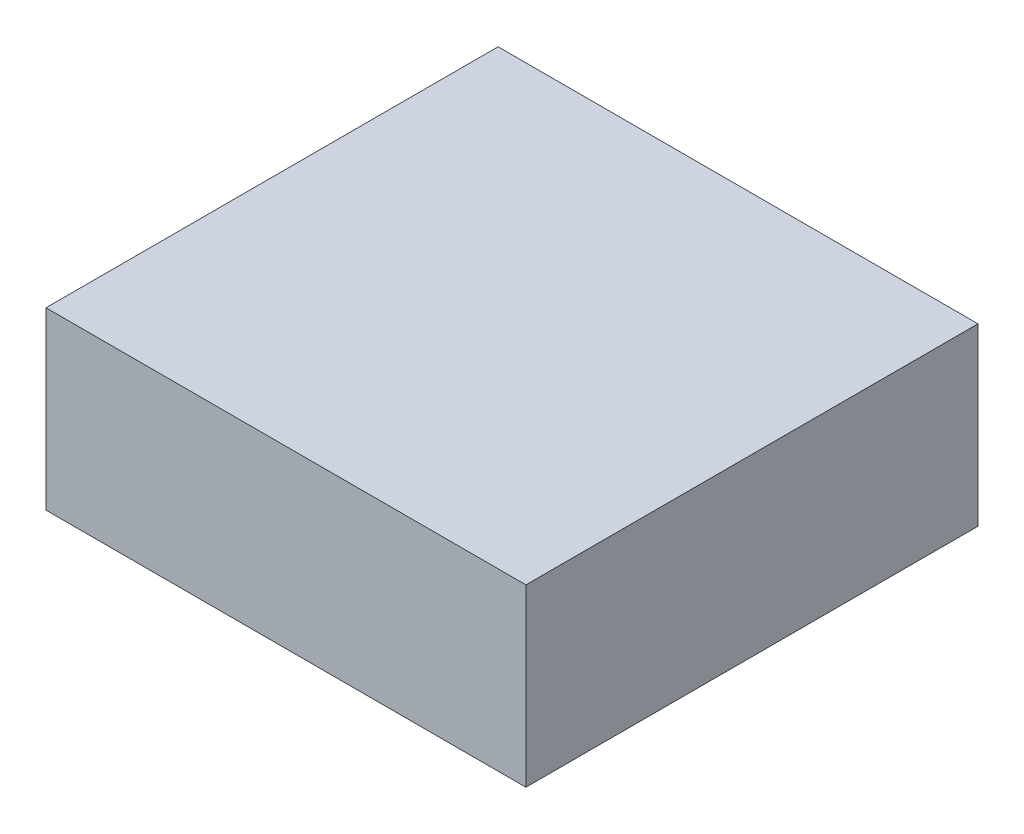
ISO-10303-21;
HEADER;
FILE_DESCRIPTION(('STEP AP214'),'2;1');
FILE_NAME('part.step','',(''),(''),'','','');
FILE_SCHEMA(('AUTOMOTIVE_DESIGN { 1 0 10303 214 1 1 1 1 }'));
ENDSEC;
DATA;
#1=APPLICATION_CONTEXT('core data for automotive mechanical design processes');
#2=APPLICATION_PROTOCOL_DEFINITION('international standard','automotive_design',2000,#1);
#3=PRODUCT_CONTEXT('',#1,'mechanical');
#4=PRODUCT('Part','Part','',(#3));
#5=PRODUCT_RELATED_PRODUCT_CATEGORY('part','',(#4));
#6=PRODUCT_DEFINITION_FORMATION('','',#4);
#7=PRODUCT_DEFINITION_CONTEXT('part definition',#1,'design');
#8=PRODUCT_DEFINITION('design','',#6,#7);
#9=PRODUCT_DEFINITION_SHAPE('','',#8);
#10=(LENGTH_UNIT() NAMED_UNIT(*) SI_UNIT(.MILLI.,.METRE.));
#11=(NAMED_UNIT(*) PLANE_ANGLE_UNIT() SI_UNIT($,.RADIAN.));
#12=(NAMED_UNIT(*) SI_UNIT($,.STERADIAN.) SOLID_ANGLE_UNIT());
#13=UNCERTAINTY_MEASURE_WITH_UNIT(LENGTH_MEASURE(1.E-05),#10,'distance_accuracy_value','');
#14=(GEOMETRIC_REPRESENTATION_CONTEXT(3) GLOBAL_UNCERTAINTY_ASSIGNED_CONTEXT((#13)) GLOBAL_UNIT_ASSIGNED_CONTEXT((#10,
#11,#12)) REPRESENTATION_CONTEXT('',''));
#15=CARTESIAN_POINT('',(0.,0.,0.));
#16=DIRECTION('',(0.,0.,1.));
#17=DIRECTION('',(1.,0.,0.));
#18=AXIS2_PLACEMENT_3D('',#15,#16,#17);
#19=CARTESIAN_POINT('',(17.25,12.6,-16.25));
#20=DIRECTION('',(-1.,0.,0.));
#21=DIRECTION('',(0.,0.,1.));
#22=AXIS2_PLACEMENT_3D('',#19,#20,#21);
#23=PLANE('',#22);
#24=DIRECTION('',(0.,0.,-1.));
#25=VECTOR('',#24,1.);
#26=CARTESIAN_POINT('',(17.25,0.,-16.25));
#27=LINE('',#26,#25);
#28=CARTESIAN_POINT('',(17.25,0.,16.25));
#29=VERTEX_POINT('',#28);
#30=CARTESIAN_POINT('',(17.25,0.,-16.25));
#31=VERTEX_POINT('',#30);
#32=EDGE_CURVE('E96',#29,#31,#27,.T.);
#33=ORIENTED_EDGE('',*,*,#32,.T.);
#34=DIRECTION('',(0.,-1.,0.));
#35=VECTOR('',#34,1.);
#36=CARTESIAN_POINT('',(17.25,12.6,-16.25));
#37=LINE('',#36,#35);
#38=CARTESIAN_POINT('',(17.25,12.6,-16.25));
#39=VERTEX_POINT('',#38);
#40=EDGE_CURVE('E11',#39,#31,#37,.T.);
#41=ORIENTED_EDGE('',*,*,#40,.F.);
#42=DIRECTION('',(0.,0.,-1.));
#43=VECTOR('',#42,1.);
#44=CARTESIAN_POINT('',(17.25,12.6,-16.25));
#45=LINE('',#44,#43);
#46=CARTESIAN_POINT('',(17.25,12.6,16.25));
#47=VERTEX_POINT('',#46);
#48=EDGE_CURVE('E84',#47,#39,#45,.T.);
#49=ORIENTED_EDGE('',*,*,#48,.F.);
#50=DIRECTION('',(0.,-1.,0.));
#51=VECTOR('',#50,1.);
#52=CARTESIAN_POINT('',(17.25,12.6,16.25));
#53=LINE('',#52,#51);
#54=EDGE_CURVE('E92',#47,#29,#53,.T.);
#55=ORIENTED_EDGE('',*,*,#54,.T.);
#56=EDGE_LOOP('',(#33,#41,#49,#55));
#57=FACE_BOUND('',#56,.T.);
#58=ADVANCED_FACE('F33',(#57),#23,.F.);
#59=CARTESIAN_POINT('',(-17.25,12.6,-16.25));
#60=DIRECTION('',(0.,0.,1.));
#61=DIRECTION('',(1.,0.,0.));
#62=AXIS2_PLACEMENT_3D('',#59,#60,#61);
#63=PLANE('',#62);
#64=DIRECTION('',(-1.,0.,0.));
#65=VECTOR('',#64,1.);
#66=CARTESIAN_POINT('',(-17.25,0.,-16.25));
#67=LINE('',#66,#65);
#68=CARTESIAN_POINT('',(-17.25,0.,-16.25));
#69=VERTEX_POINT('',#68);
#70=EDGE_CURVE('E88',#31,#69,#67,.T.);
#71=ORIENTED_EDGE('',*,*,#70,.T.);
#72=DIRECTION('',(0.,-1.,0.));
#73=VECTOR('',#72,1.);
#74=CARTESIAN_POINT('',(-17.25,12.6,-16.25));
#75=LINE('',#74,#73);
#76=CARTESIAN_POINT('',(-17.25,12.6,-16.25));
#77=VERTEX_POINT('',#76);
#78=EDGE_CURVE('E41',#77,#69,#75,.T.);
#79=ORIENTED_EDGE('',*,*,#78,.F.);
#80=DIRECTION('',(-1.,0.,0.));
#81=VECTOR('',#80,1.);
#82=CARTESIAN_POINT('',(-17.25,12.6,-16.25));
#83=LINE('',#82,#81);
#84=EDGE_CURVE('E79',#39,#77,#83,.T.);
#85=ORIENTED_EDGE('',*,*,#84,.F.);
#86=ORIENTED_EDGE('',*,*,#40,.T.);
#87=EDGE_LOOP('',(#71,#79,#85,#86));
#88=FACE_BOUND('',#87,.T.);
#89=ADVANCED_FACE('F87',(#88),#63,.F.);
#90=CARTESIAN_POINT('',(-17.25,12.6,-16.25));
#91=DIRECTION('',(1.,0.,0.));
#92=DIRECTION('',(0.,0.,-1.));
#93=AXIS2_PLACEMENT_3D('',#90,#91,#92);
#94=PLANE('',#93);
#95=DIRECTION('',(0.,0.,1.));
#96=VECTOR('',#95,1.);
#97=CARTESIAN_POINT('',(-17.25,0.,-16.25));
#98=LINE('',#97,#96);
#99=CARTESIAN_POINT('',(-17.25,0.,16.25));
#100=VERTEX_POINT('',#99);
#101=EDGE_CURVE('E66',#69,#100,#98,.T.);
#102=ORIENTED_EDGE('',*,*,#101,.T.);
#103=DIRECTION('',(0.,-1.,0.));
#104=VECTOR('',#103,1.);
#105=CARTESIAN_POINT('',(-17.25,12.6,16.25));
#106=LINE('',#105,#104);
#107=CARTESIAN_POINT('',(-17.25,12.6,16.25));
#108=VERTEX_POINT('',#107);
#109=EDGE_CURVE('E89',#108,#100,#106,.T.);
#110=ORIENTED_EDGE('',*,*,#109,.F.);
#111=DIRECTION('',(0.,0.,1.));
#112=VECTOR('',#111,1.);
#113=CARTESIAN_POINT('',(-17.25,12.6,-16.25));
#114=LINE('',#113,#112);
#115=EDGE_CURVE('E82',#77,#108,#114,.T.);
#116=ORIENTED_EDGE('',*,*,#115,.F.);
#117=ORIENTED_EDGE('',*,*,#78,.T.);
#118=EDGE_LOOP('',(#102,#110,#116,#117));
#119=FACE_BOUND('',#118,.T.);
#120=ADVANCED_FACE('F90',(#119),#94,.F.);
#121=CARTESIAN_POINT('',(-17.25,12.6,16.25));
#122=DIRECTION('',(0.,0.,-1.));
#123=DIRECTION('',(-1.,0.,0.));
#124=AXIS2_PLACEMENT_3D('',#121,#122,#123);
#125=PLANE('',#124);
#126=DIRECTION('',(1.,0.,0.));
#127=VECTOR('',#126,1.);
#128=CARTESIAN_POINT('',(-17.25,0.,16.25));
#129=LINE('',#128,#127);
#130=EDGE_CURVE('E72',#100,#29,#129,.T.);
#131=ORIENTED_EDGE('',*,*,#130,.T.);
#132=ORIENTED_EDGE('',*,*,#54,.F.);
#133=DIRECTION('',(1.,0.,0.));
#134=VECTOR('',#133,1.);
#135=CARTESIAN_POINT('',(-17.25,12.6,16.25));
#136=LINE('',#135,#134);
#137=EDGE_CURVE('E49',#108,#47,#136,.T.);
#138=ORIENTED_EDGE('',*,*,#137,.F.);
#139=ORIENTED_EDGE('',*,*,#109,.T.);
#140=EDGE_LOOP('',(#131,#132,#138,#139));
#141=FACE_BOUND('',#140,.T.);
#142=ADVANCED_FACE('F103',(#141),#125,.F.);
#143=CARTESIAN_POINT('',(0.,12.6,0.));
#144=DIRECTION('',(0.,1.,0.));
#145=DIRECTION('',(0.,0.,1.));
#146=AXIS2_PLACEMENT_3D('',#143,#144,#145);
#147=PLANE('',#146);
#148=ORIENTED_EDGE('',*,*,#48,.T.);
#149=ORIENTED_EDGE('',*,*,#84,.T.);
#150=ORIENTED_EDGE('',*,*,#115,.T.);
#151=ORIENTED_EDGE('',*,*,#137,.T.);
#152=EDGE_LOOP('',(#148,#149,#150,#151));
#153=FACE_BOUND('',#152,.T.);
#154=ADVANCED_FACE('F80',(#153),#147,.T.);
#155=CARTESIAN_POINT('',(0.,0.,0.));
#156=DIRECTION('',(0.,1.,0.));
#157=DIRECTION('',(0.,0.,1.));
#158=AXIS2_PLACEMENT_3D('',#155,#156,#157);
#159=PLANE('',#158);
#160=ORIENTED_EDGE('',*,*,#32,.F.);
#161=ORIENTED_EDGE('',*,*,#130,.F.);
#162=ORIENTED_EDGE('',*,*,#101,.F.);
#163=ORIENTED_EDGE('',*,*,#70,.F.);
#164=EDGE_LOOP('',(#160,#161,#162,#163));
#165=FACE_BOUND('',#164,.T.);
#166=ADVANCED_FACE('F106',(#165),#159,.F.);
#167=CLOSED_SHELL('',(#58,#89,#120,#142,#154,#166));
#168=MANIFOLD_SOLID_BREP('B2',#167);
#169=ADVANCED_BREP_SHAPE_REPRESENTATION('',(#18,#168),#14);
#170=SHAPE_DEFINITION_REPRESENTATION(#9,#169);
ENDSEC;
END-ISO-10303-21;
